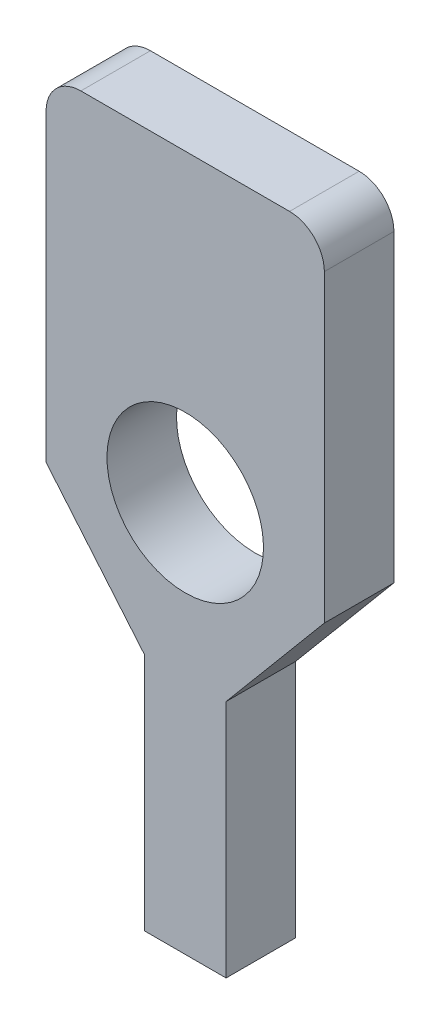
ISO-10303-21;
HEADER;
FILE_DESCRIPTION(('STEP AP214'),'2;1');
FILE_NAME('part.step','',(''),(''),'','','');
FILE_SCHEMA(('AUTOMOTIVE_DESIGN { 1 0 10303 214 1 1 1 1 }'));
ENDSEC;
DATA;
#1=APPLICATION_CONTEXT('core data for automotive mechanical design processes');
#2=APPLICATION_PROTOCOL_DEFINITION('international standard','automotive_design',2000,#1);
#3=PRODUCT_CONTEXT('',#1,'mechanical');
#4=PRODUCT('Part','Part','',(#3));
#5=PRODUCT_RELATED_PRODUCT_CATEGORY('part','',(#4));
#6=PRODUCT_DEFINITION_FORMATION('','',#4);
#7=PRODUCT_DEFINITION_CONTEXT('part definition',#1,'design');
#8=PRODUCT_DEFINITION('design','',#6,#7);
#9=PRODUCT_DEFINITION_SHAPE('','',#8);
#10=(LENGTH_UNIT() NAMED_UNIT(*) SI_UNIT(.MILLI.,.METRE.));
#11=(NAMED_UNIT(*) PLANE_ANGLE_UNIT() SI_UNIT($,.RADIAN.));
#12=(NAMED_UNIT(*) SI_UNIT($,.STERADIAN.) SOLID_ANGLE_UNIT());
#13=UNCERTAINTY_MEASURE_WITH_UNIT(LENGTH_MEASURE(1.E-05),#10,'distance_accuracy_value','');
#14=(GEOMETRIC_REPRESENTATION_CONTEXT(3) GLOBAL_UNCERTAINTY_ASSIGNED_CONTEXT((#13)) GLOBAL_UNIT_ASSIGNED_CONTEXT((#10,
#11,#12)) REPRESENTATION_CONTEXT('',''));
#15=CARTESIAN_POINT('',(0.,0.,0.));
#16=DIRECTION('',(0.,0.,1.));
#17=DIRECTION('',(1.,0.,0.));
#18=AXIS2_PLACEMENT_3D('',#15,#16,#17);
#19=CARTESIAN_POINT('',(9.85100000000116,-0.151,-7.4));
#20=DIRECTION('',(0.,0.,-1.));
#21=DIRECTION('',(-1.,0.,0.));
#22=AXIS2_PLACEMENT_3D('',#19,#20,#21);
#23=PLANE('',#22);
#24=CARTESIAN_POINT('',(9.05,2.1,-7.4));
#25=DIRECTION('',(0.,0.,1.));
#26=DIRECTION('',(0.,-1.,0.));
#27=AXIS2_PLACEMENT_3D('',#24,#25,#26);
#28=CIRCLE('',#27,0.450000000000001);
#29=CARTESIAN_POINT('',(9.05,1.65,-7.4));
#30=VERTEX_POINT('',#29);
#31=EDGE_CURVE('E141',#30,#30,#28,.F.);
#32=ORIENTED_EDGE('',*,*,#31,.F.);
#33=EDGE_LOOP('',(#32));
#34=FACE_BOUND('',#33,.T.);
#35=DIRECTION('',(0.,1.,0.));
#36=VECTOR('',#35,1.);
#37=CARTESIAN_POINT('',(9.85,2.775,-7.4));
#38=LINE('',#37,#36);
#39=CARTESIAN_POINT('',(9.85,1.89999999999882,-7.4));
#40=VERTEX_POINT('',#39);
#41=CARTESIAN_POINT('',(9.85,3.65,-7.4));
#42=VERTEX_POINT('',#41);
#43=EDGE_CURVE('E98',#40,#42,#38,.T.);
#44=ORIENTED_EDGE('',*,*,#43,.F.);
#45=DIRECTION('',(-0.642787609686802,-0.766044443118758,0.));
#46=VECTOR('',#45,1.);
#47=CARTESIAN_POINT('',(9.85000000000116,1.89999999999902,-7.4));
#48=LINE('',#47,#46);
#49=CARTESIAN_POINT('',(9.28499999999912,1.22665922018192,-7.4));
#50=VERTEX_POINT('',#49);
#51=EDGE_CURVE('E21',#40,#50,#48,.T.);
#52=ORIENTED_EDGE('',*,*,#51,.T.);
#53=DIRECTION('',(0.,-1.,0.));
#54=VECTOR('',#53,1.);
#55=CARTESIAN_POINT('',(9.285,1.85,-7.4));
#56=LINE('',#55,#54);
#57=CARTESIAN_POINT('',(9.285,-0.15,-7.4));
#58=VERTEX_POINT('',#57);
#59=EDGE_CURVE('E148',#50,#58,#56,.T.);
#60=ORIENTED_EDGE('',*,*,#59,.T.);
#61=DIRECTION('',(-1.,0.,0.));
#62=VECTOR('',#61,1.);
#63=CARTESIAN_POINT('',(9.05,-0.15,-7.4));
#64=LINE('',#63,#62);
#65=CARTESIAN_POINT('',(8.815,-0.15,-7.4));
#66=VERTEX_POINT('',#65);
#67=EDGE_CURVE('E99',#58,#66,#64,.T.);
#68=ORIENTED_EDGE('',*,*,#67,.T.);
#69=DIRECTION('',(0.,-1.,0.));
#70=VECTOR('',#69,1.);
#71=CARTESIAN_POINT('',(8.815,0.53832961009,-7.4));
#72=LINE('',#71,#70);
#73=CARTESIAN_POINT('',(8.81500000000234,1.22665922018196,-7.4));
#74=VERTEX_POINT('',#73);
#75=EDGE_CURVE('E133',#74,#66,#72,.T.);
#76=ORIENTED_EDGE('',*,*,#75,.F.);
#77=DIRECTION('',(0.642787609686804,-0.766044443118756,0.));
#78=VECTOR('',#77,1.);
#79=CARTESIAN_POINT('',(8.53250000000116,1.56332961009098,-7.4));
#80=LINE('',#79,#78);
#81=CARTESIAN_POINT('',(8.25,1.9,-7.4));
#82=VERTEX_POINT('',#81);
#83=EDGE_CURVE('E127',#82,#74,#80,.T.);
#84=ORIENTED_EDGE('',*,*,#83,.F.);
#85=DIRECTION('',(0.,-1.,0.));
#86=VECTOR('',#85,1.);
#87=CARTESIAN_POINT('',(8.25,2.775,-7.4));
#88=LINE('',#87,#86);
#89=CARTESIAN_POINT('',(8.25,3.65,-7.4));
#90=VERTEX_POINT('',#89);
#91=EDGE_CURVE('E120',#90,#82,#88,.T.);
#92=ORIENTED_EDGE('',*,*,#91,.F.);
#93=CARTESIAN_POINT('',(8.45,3.65,-7.4));
#94=DIRECTION('',(0.,0.,-1.));
#95=DIRECTION('',(0.,1.,0.));
#96=AXIS2_PLACEMENT_3D('',#93,#94,#95);
#97=CIRCLE('',#96,0.2);
#98=CARTESIAN_POINT('',(8.45,3.85,-7.4));
#99=VERTEX_POINT('',#98);
#100=EDGE_CURVE('E180',#99,#90,#97,.F.);
#101=ORIENTED_EDGE('',*,*,#100,.F.);
#102=DIRECTION('',(-1.,0.,0.));
#103=VECTOR('',#102,1.);
#104=CARTESIAN_POINT('',(9.05,3.85,-7.4));
#105=LINE('',#104,#103);
#106=CARTESIAN_POINT('',(9.65,3.85,-7.4));
#107=VERTEX_POINT('',#106);
#108=EDGE_CURVE('E144',#107,#99,#105,.T.);
#109=ORIENTED_EDGE('',*,*,#108,.F.);
#110=CARTESIAN_POINT('',(9.65,3.65,-7.4));
#111=DIRECTION('',(0.,0.,-1.));
#112=DIRECTION('',(0.,1.,0.));
#113=AXIS2_PLACEMENT_3D('',#110,#111,#112);
#114=CIRCLE('',#113,0.2);
#115=EDGE_CURVE('E102',#42,#107,#114,.F.);
#116=ORIENTED_EDGE('',*,*,#115,.F.);
#117=EDGE_LOOP('',(#44,#52,#60,#68,#76,#84,#92,#101,#109,#116));
#118=FACE_BOUND('',#117,.T.);
#119=ADVANCED_FACE('F17',(#34,#118),#23,.T.);
#120=CARTESIAN_POINT('',(9.85,3.651,-6.999));
#121=DIRECTION('',(1.,0.,0.));
#122=DIRECTION('',(0.,-1.,0.));
#123=AXIS2_PLACEMENT_3D('',#120,#121,#122);
#124=PLANE('',#123);
#125=DIRECTION('',(0.,1.,0.));
#126=VECTOR('',#125,1.);
#127=CARTESIAN_POINT('',(9.85,1.85,-7.));
#128=LINE('',#127,#126);
#129=CARTESIAN_POINT('',(9.85000000000039,1.89999999999967,-7.));
#130=VERTEX_POINT('',#129);
#131=CARTESIAN_POINT('',(9.85,3.65,-7.));
#132=VERTEX_POINT('',#131);
#133=EDGE_CURVE('E108',#130,#132,#128,.T.);
#134=ORIENTED_EDGE('',*,*,#133,.F.);
#135=DIRECTION('',(0.,0.,-1.));
#136=VECTOR('',#135,1.);
#137=CARTESIAN_POINT('',(9.85,1.9,-7.2));
#138=LINE('',#137,#136);
#139=EDGE_CURVE('E94',#130,#40,#138,.T.);
#140=ORIENTED_EDGE('',*,*,#139,.T.);
#141=ORIENTED_EDGE('',*,*,#43,.T.);
#142=DIRECTION('',(0.,0.,-1.));
#143=VECTOR('',#142,1.);
#144=CARTESIAN_POINT('',(9.85,3.65,-7.2));
#145=LINE('',#144,#143);
#146=EDGE_CURVE('E110',#132,#42,#145,.T.);
#147=ORIENTED_EDGE('',*,*,#146,.F.);
#148=EDGE_LOOP('',(#134,#140,#141,#147));
#149=FACE_BOUND('',#148,.T.);
#150=ADVANCED_FACE('F106',(#149),#124,.T.);
#151=CARTESIAN_POINT('',(9.65,3.65,-7.));
#152=DIRECTION('',(0.,0.,-1.));
#153=DIRECTION('',(0.,1.,0.));
#154=AXIS2_PLACEMENT_3D('',#151,#152,#153);
#155=CYLINDRICAL_SURFACE('',#154,0.2);
#156=CARTESIAN_POINT('',(9.65,3.65,-7.));
#157=DIRECTION('',(0.,0.,-1.));
#158=DIRECTION('',(0.,1.,0.));
#159=AXIS2_PLACEMENT_3D('',#156,#157,#158);
#160=CIRCLE('',#159,0.2);
#161=CARTESIAN_POINT('',(9.65,3.85,-7.));
#162=VERTEX_POINT('',#161);
#163=EDGE_CURVE('E174',#132,#162,#160,.F.);
#164=ORIENTED_EDGE('',*,*,#163,.F.);
#165=ORIENTED_EDGE('',*,*,#146,.T.);
#166=ORIENTED_EDGE('',*,*,#115,.T.);
#167=DIRECTION('',(0.,0.,-1.));
#168=VECTOR('',#167,1.);
#169=CARTESIAN_POINT('',(9.65,3.85,-7.2));
#170=LINE('',#169,#168);
#171=EDGE_CURVE('E146',#162,#107,#170,.T.);
#172=ORIENTED_EDGE('',*,*,#171,.F.);
#173=EDGE_LOOP('',(#164,#165,#166,#172));
#174=FACE_BOUND('',#173,.T.);
#175=ADVANCED_FACE('F212',(#174),#155,.T.);
#176=CARTESIAN_POINT('',(8.449,3.85,-6.999));
#177=DIRECTION('',(0.,1.,0.));
#178=DIRECTION('',(1.,0.,0.));
#179=AXIS2_PLACEMENT_3D('',#176,#177,#178);
#180=PLANE('',#179);
#181=DIRECTION('',(-1.,0.,0.));
#182=VECTOR('',#181,1.);
#183=CARTESIAN_POINT('',(9.05,3.85,-7.));
#184=LINE('',#183,#182);
#185=CARTESIAN_POINT('',(8.45,3.85,-7.));
#186=VERTEX_POINT('',#185);
#187=EDGE_CURVE('E173',#162,#186,#184,.T.);
#188=ORIENTED_EDGE('',*,*,#187,.F.);
#189=ORIENTED_EDGE('',*,*,#171,.T.);
#190=ORIENTED_EDGE('',*,*,#108,.T.);
#191=DIRECTION('',(0.,0.,-1.));
#192=VECTOR('',#191,1.);
#193=CARTESIAN_POINT('',(8.45,3.85,-7.2));
#194=LINE('',#193,#192);
#195=EDGE_CURVE('E124',#186,#99,#194,.T.);
#196=ORIENTED_EDGE('',*,*,#195,.F.);
#197=EDGE_LOOP('',(#188,#189,#190,#196));
#198=FACE_BOUND('',#197,.T.);
#199=ADVANCED_FACE('F213',(#198),#180,.T.);
#200=CARTESIAN_POINT('',(8.45,3.65,-7.));
#201=DIRECTION('',(0.,0.,-1.));
#202=DIRECTION('',(0.,1.,0.));
#203=AXIS2_PLACEMENT_3D('',#200,#201,#202);
#204=CYLINDRICAL_SURFACE('',#203,0.2);
#205=CARTESIAN_POINT('',(8.45,3.65,-7.));
#206=DIRECTION('',(0.,0.,-1.));
#207=DIRECTION('',(0.,1.,0.));
#208=AXIS2_PLACEMENT_3D('',#205,#206,#207);
#209=CIRCLE('',#208,0.2);
#210=CARTESIAN_POINT('',(8.25,3.65,-7.));
#211=VERTEX_POINT('',#210);
#212=EDGE_CURVE('E170',#186,#211,#209,.F.);
#213=ORIENTED_EDGE('',*,*,#212,.F.);
#214=ORIENTED_EDGE('',*,*,#195,.T.);
#215=ORIENTED_EDGE('',*,*,#100,.T.);
#216=DIRECTION('',(0.,0.,-1.));
#217=VECTOR('',#216,1.);
#218=CARTESIAN_POINT('',(8.25,3.65,-7.2));
#219=LINE('',#218,#217);
#220=EDGE_CURVE('E123',#211,#90,#219,.T.);
#221=ORIENTED_EDGE('',*,*,#220,.F.);
#222=EDGE_LOOP('',(#213,#214,#215,#221));
#223=FACE_BOUND('',#222,.T.);
#224=ADVANCED_FACE('F215',(#223),#204,.T.);
#225=CARTESIAN_POINT('',(8.25,1.899,-6.999));
#226=DIRECTION('',(-1.,0.,0.));
#227=DIRECTION('',(0.,1.,0.));
#228=AXIS2_PLACEMENT_3D('',#225,#226,#227);
#229=PLANE('',#228);
#230=DIRECTION('',(0.,-1.,0.));
#231=VECTOR('',#230,1.);
#232=CARTESIAN_POINT('',(8.25,1.85,-7.));
#233=LINE('',#232,#231);
#234=CARTESIAN_POINT('',(8.25,1.89999999999881,-7.));
#235=VERTEX_POINT('',#234);
#236=EDGE_CURVE('E169',#211,#235,#233,.T.);
#237=ORIENTED_EDGE('',*,*,#236,.F.);
#238=ORIENTED_EDGE('',*,*,#220,.T.);
#239=ORIENTED_EDGE('',*,*,#91,.T.);
#240=DIRECTION('',(0.,0.,-1.));
#241=VECTOR('',#240,1.);
#242=CARTESIAN_POINT('',(8.25,1.9,-7.2));
#243=LINE('',#242,#241);
#244=EDGE_CURVE('E130',#235,#82,#243,.T.);
#245=ORIENTED_EDGE('',*,*,#244,.F.);
#246=EDGE_LOOP('',(#237,#238,#239,#245));
#247=FACE_BOUND('',#246,.T.);
#248=ADVANCED_FACE('F219',(#247),#229,.T.);
#249=CARTESIAN_POINT('',(8.81564278761202,1.22589317573884,-6.999));
#250=DIRECTION('',(-0.766044443118756,-0.642787609686804,0.));
#251=DIRECTION('',(-0.642787609686804,0.766044443118756,0.));
#252=AXIS2_PLACEMENT_3D('',#249,#250,#251);
#253=PLANE('',#252);
#254=DIRECTION('',(0.642787609686807,-0.766044443118754,0.));
#255=VECTOR('',#254,1.);
#256=CARTESIAN_POINT('',(8.24999999999883,1.89999999999902,-7.));
#257=LINE('',#256,#255);
#258=CARTESIAN_POINT('',(8.815,1.22665922018119,-7.));
#259=VERTEX_POINT('',#258);
#260=EDGE_CURVE('E163',#235,#259,#257,.T.);
#261=ORIENTED_EDGE('',*,*,#260,.F.);
#262=ORIENTED_EDGE('',*,*,#244,.T.);
#263=ORIENTED_EDGE('',*,*,#83,.T.);
#264=DIRECTION('',(0.,0.,-1.));
#265=VECTOR('',#264,1.);
#266=CARTESIAN_POINT('',(8.815,1.22665922018,-7.2));
#267=LINE('',#266,#265);
#268=EDGE_CURVE('E136',#259,#74,#267,.T.);
#269=ORIENTED_EDGE('',*,*,#268,.F.);
#270=EDGE_LOOP('',(#261,#262,#263,#269));
#271=FACE_BOUND('',#270,.T.);
#272=ADVANCED_FACE('F221',(#271),#253,.T.);
#273=CARTESIAN_POINT('',(8.815,-0.151,-6.999));
#274=DIRECTION('',(-1.,0.,0.));
#275=DIRECTION('',(0.,1.,0.));
#276=AXIS2_PLACEMENT_3D('',#273,#274,#275);
#277=PLANE('',#276);
#278=DIRECTION('',(0.,-1.,0.));
#279=VECTOR('',#278,1.);
#280=CARTESIAN_POINT('',(8.815,1.85,-7.));
#281=LINE('',#280,#279);
#282=CARTESIAN_POINT('',(8.815,-0.15,-7.));
#283=VERTEX_POINT('',#282);
#284=EDGE_CURVE('E159',#259,#283,#281,.T.);
#285=ORIENTED_EDGE('',*,*,#284,.F.);
#286=ORIENTED_EDGE('',*,*,#268,.T.);
#287=ORIENTED_EDGE('',*,*,#75,.T.);
#288=DIRECTION('',(0.,0.,-1.));
#289=VECTOR('',#288,1.);
#290=CARTESIAN_POINT('',(8.815,-0.15,-7.2));
#291=LINE('',#290,#289);
#292=EDGE_CURVE('E179',#283,#66,#291,.T.);
#293=ORIENTED_EDGE('',*,*,#292,.F.);
#294=EDGE_LOOP('',(#285,#286,#287,#293));
#295=FACE_BOUND('',#294,.T.);
#296=ADVANCED_FACE('F224',(#295),#277,.T.);
#297=CARTESIAN_POINT('',(9.05,2.1,-7.4));
#298=DIRECTION('',(0.,0.,1.));
#299=DIRECTION('',(0.,-1.,0.));
#300=AXIS2_PLACEMENT_3D('',#297,#298,#299);
#301=CYLINDRICAL_SURFACE('',#300,0.450000000000001);
#302=CARTESIAN_POINT('',(9.05,2.1,-7.));
#303=DIRECTION('',(0.,0.,1.));
#304=DIRECTION('',(0.,-1.,0.));
#305=AXIS2_PLACEMENT_3D('',#302,#303,#304);
#306=CIRCLE('',#305,0.450000000000001);
#307=CARTESIAN_POINT('',(9.05,1.65,-7.));
#308=VERTEX_POINT('',#307);
#309=EDGE_CURVE('E164',#308,#308,#306,.F.);
#310=ORIENTED_EDGE('',*,*,#309,.F.);
#311=EDGE_LOOP('',(#310));
#312=FACE_BOUND('',#311,.T.);
#313=ORIENTED_EDGE('',*,*,#31,.T.);
#314=EDGE_LOOP('',(#313));
#315=FACE_BOUND('',#314,.T.);
#316=ADVANCED_FACE('F229',(#312,#315),#301,.F.);
#317=CARTESIAN_POINT('',(9.286,-0.15,-6.999));
#318=DIRECTION('',(0.,-1.,0.));
#319=DIRECTION('',(-1.,0.,0.));
#320=AXIS2_PLACEMENT_3D('',#317,#318,#319);
#321=PLANE('',#320);
#322=DIRECTION('',(1.,0.,0.));
#323=VECTOR('',#322,1.);
#324=CARTESIAN_POINT('',(9.05,-0.15,-7.));
#325=LINE('',#324,#323);
#326=CARTESIAN_POINT('',(9.285,-0.15,-7.));
#327=VERTEX_POINT('',#326);
#328=EDGE_CURVE('E162',#283,#327,#325,.T.);
#329=ORIENTED_EDGE('',*,*,#328,.F.);
#330=ORIENTED_EDGE('',*,*,#292,.T.);
#331=ORIENTED_EDGE('',*,*,#67,.F.);
#332=DIRECTION('',(0.,0.,-1.));
#333=VECTOR('',#332,1.);
#334=CARTESIAN_POINT('',(9.285,-0.15,-7.2));
#335=LINE('',#334,#333);
#336=EDGE_CURVE('E117',#327,#58,#335,.T.);
#337=ORIENTED_EDGE('',*,*,#336,.F.);
#338=EDGE_LOOP('',(#329,#330,#331,#337));
#339=FACE_BOUND('',#338,.T.);
#340=ADVANCED_FACE('F227',(#339),#321,.T.);
#341=CARTESIAN_POINT('',(8.24899999999884,-0.151,-7.));
#342=DIRECTION('',(0.,0.,1.));
#343=DIRECTION('',(1.,0.,0.));
#344=AXIS2_PLACEMENT_3D('',#341,#342,#343);
#345=PLANE('',#344);
#346=ORIENTED_EDGE('',*,*,#309,.T.);
#347=EDGE_LOOP('',(#346));
#348=FACE_BOUND('',#347,.T.);
#349=ORIENTED_EDGE('',*,*,#328,.T.);
#350=DIRECTION('',(0.,-1.,0.));
#351=VECTOR('',#350,1.);
#352=CARTESIAN_POINT('',(9.285,0.53832961009,-7.));
#353=LINE('',#352,#351);
#354=CARTESIAN_POINT('',(9.28499999999883,1.22665922018098,-7.));
#355=VERTEX_POINT('',#354);
#356=EDGE_CURVE('E36',#355,#327,#353,.T.);
#357=ORIENTED_EDGE('',*,*,#356,.F.);
#358=DIRECTION('',(-0.642787609686805,-0.766044443118755,0.));
#359=VECTOR('',#358,1.);
#360=CARTESIAN_POINT('',(9.56749999999884,1.56332961009098,-7.));
#361=LINE('',#360,#359);
#362=EDGE_CURVE('E27',#130,#355,#361,.T.);
#363=ORIENTED_EDGE('',*,*,#362,.F.);
#364=ORIENTED_EDGE('',*,*,#133,.T.);
#365=ORIENTED_EDGE('',*,*,#163,.T.);
#366=ORIENTED_EDGE('',*,*,#187,.T.);
#367=ORIENTED_EDGE('',*,*,#212,.T.);
#368=ORIENTED_EDGE('',*,*,#236,.T.);
#369=ORIENTED_EDGE('',*,*,#260,.T.);
#370=ORIENTED_EDGE('',*,*,#284,.T.);
#371=EDGE_LOOP('',(#349,#357,#363,#364,#365,#366,#367,#368,#369,#370));
#372=FACE_BOUND('',#371,.T.);
#373=ADVANCED_FACE('F209',(#348,#372),#345,.T.);
#374=CARTESIAN_POINT('',(9.285,1.22765922018,-6.999));
#375=DIRECTION('',(1.,0.,0.));
#376=DIRECTION('',(0.,-1.,0.));
#377=AXIS2_PLACEMENT_3D('',#374,#375,#376);
#378=PLANE('',#377);
#379=ORIENTED_EDGE('',*,*,#356,.T.);
#380=ORIENTED_EDGE('',*,*,#336,.T.);
#381=ORIENTED_EDGE('',*,*,#59,.F.);
#382=DIRECTION('',(0.,0.,-1.));
#383=VECTOR('',#382,1.);
#384=CARTESIAN_POINT('',(9.28499999999767,1.22665922018196,-7.2));
#385=LINE('',#384,#383);
#386=EDGE_CURVE('E11',#355,#50,#385,.T.);
#387=ORIENTED_EDGE('',*,*,#386,.F.);
#388=EDGE_LOOP('',(#379,#380,#381,#387));
#389=FACE_BOUND('',#388,.T.);
#390=ADVANCED_FACE('F206',(#389),#378,.T.);
#391=CARTESIAN_POINT('',(9.85064278760969,1.90076604444312,-6.999));
#392=DIRECTION('',(0.766044443118755,-0.642787609686805,0.));
#393=DIRECTION('',(-0.642787609686805,-0.766044443118755,0.));
#394=AXIS2_PLACEMENT_3D('',#391,#392,#393);
#395=PLANE('',#394);
#396=ORIENTED_EDGE('',*,*,#362,.T.);
#397=ORIENTED_EDGE('',*,*,#386,.T.);
#398=ORIENTED_EDGE('',*,*,#51,.F.);
#399=ORIENTED_EDGE('',*,*,#139,.F.);
#400=EDGE_LOOP('',(#396,#397,#398,#399));
#401=FACE_BOUND('',#400,.T.);
#402=ADVANCED_FACE('F19',(#401),#395,.T.);
#403=CLOSED_SHELL('',(#119,#150,#175,#199,#224,#248,#272,#296,#316,#340,#373,#390,#402));
#404=MANIFOLD_SOLID_BREP('B1',#403);
#405=ADVANCED_BREP_SHAPE_REPRESENTATION('',(#18,#404),#14);
#406=SHAPE_DEFINITION_REPRESENTATION(#9,#405);
ENDSEC;
END-ISO-10303-21;
